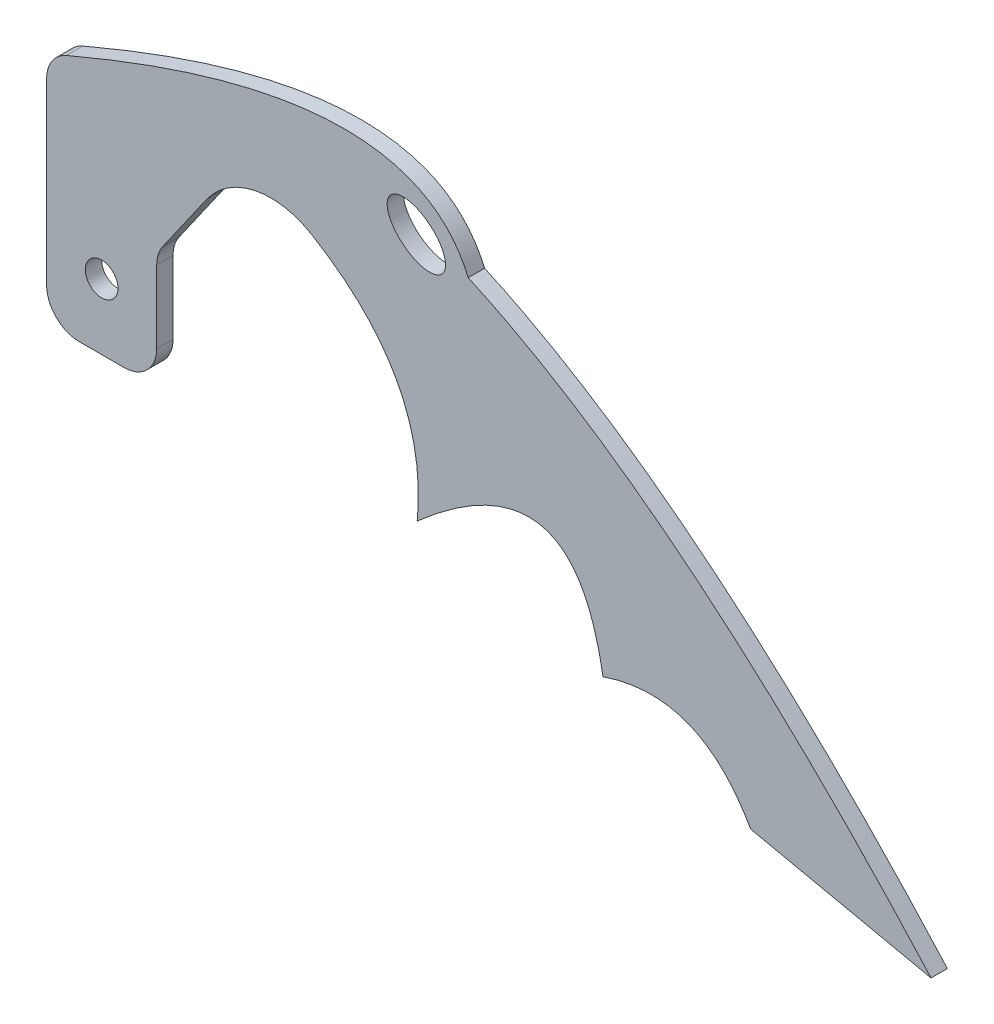
ISO-10303-21;
HEADER;
FILE_DESCRIPTION(('STEP AP214'),'2;1');
FILE_NAME('part.step','',(''),(''),'','','');
FILE_SCHEMA(('AUTOMOTIVE_DESIGN { 1 0 10303 214 1 1 1 1 }'));
ENDSEC;
DATA;
#1=APPLICATION_CONTEXT('core data for automotive mechanical design processes');
#2=APPLICATION_PROTOCOL_DEFINITION('international standard','automotive_design',2000,#1);
#3=PRODUCT_CONTEXT('',#1,'mechanical');
#4=PRODUCT('Part','Part','',(#3));
#5=PRODUCT_RELATED_PRODUCT_CATEGORY('part','',(#4));
#6=PRODUCT_DEFINITION_FORMATION('','',#4);
#7=PRODUCT_DEFINITION_CONTEXT('part definition',#1,'design');
#8=PRODUCT_DEFINITION('design','',#6,#7);
#9=PRODUCT_DEFINITION_SHAPE('','',#8);
#10=(LENGTH_UNIT() NAMED_UNIT(*) SI_UNIT(.MILLI.,.METRE.));
#11=(NAMED_UNIT(*) PLANE_ANGLE_UNIT() SI_UNIT($,.RADIAN.));
#12=(NAMED_UNIT(*) SI_UNIT($,.STERADIAN.) SOLID_ANGLE_UNIT());
#13=UNCERTAINTY_MEASURE_WITH_UNIT(LENGTH_MEASURE(1.E-05),#10,'distance_accuracy_value','');
#14=(GEOMETRIC_REPRESENTATION_CONTEXT(3) GLOBAL_UNCERTAINTY_ASSIGNED_CONTEXT((#13)) GLOBAL_UNIT_ASSIGNED_CONTEXT((#10,
#11,#12)) REPRESENTATION_CONTEXT('',''));
#15=CARTESIAN_POINT('',(0.,0.,0.));
#16=DIRECTION('',(0.,0.,1.));
#17=DIRECTION('',(1.,0.,0.));
#18=AXIS2_PLACEMENT_3D('',#15,#16,#17);
#19=CARTESIAN_POINT('',(-85.8379905464386,33.8069712216484,3.175));
#20=CARTESIAN_POINT('',(-15.7088284844414,64.7051053089829,3.175));
#21=CARTESIAN_POINT('',(-3.9965246979184,37.1134376597058,3.175));
#22=B_SPLINE_CURVE_WITH_KNOTS('',2,(#19,#20,#21),.UNSPECIFIED.,.F.,.F.,(3,3),(0.,
0.406769717209253),.UNSPECIFIED.);
#23=DIRECTION('',(0.,0.,-1.));
#24=VECTOR('',#23,1.);
#25=SURFACE_OF_LINEAR_EXTRUSION('',#22,#24);
#26=CARTESIAN_POINT('',(-85.8379905464386,33.8069712216484,0.));
#27=CARTESIAN_POINT('',(-15.7088284844414,64.7051053089829,0.));
#28=CARTESIAN_POINT('',(-3.9965246979184,37.1134376597058,0.));
#29=B_SPLINE_CURVE_WITH_KNOTS('',2,(#26,#27,#28),.UNSPECIFIED.,.F.,.F.,(3,3),(0.,
0.406769717209253),.UNSPECIFIED.);
#30=CARTESIAN_POINT('',(-81.9830787004978,35.4800790941785,0.));
#31=VERTEX_POINT('',#30);
#32=CARTESIAN_POINT('',(-3.9965246979184,37.1134376597058,0.));
#33=VERTEX_POINT('',#32);
#34=EDGE_CURVE('E289',#31,#33,#29,.T.);
#35=ORIENTED_EDGE('',*,*,#34,.F.);
#36=DIRECTION('',(0.,0.,-1.));
#37=VECTOR('',#36,1.);
#38=CARTESIAN_POINT('',(-81.9830787004978,35.4800790941785,0.));
#39=LINE('',#38,#37);
#40=CARTESIAN_POINT('',(-81.9830787004978,35.4800790941785,3.175));
#41=VERTEX_POINT('',#40);
#42=EDGE_CURVE('E43',#31,#41,#39,.F.);
#43=ORIENTED_EDGE('',*,*,#42,.T.);
#44=CARTESIAN_POINT('',(-3.9965246979184,37.1134376597058,3.175));
#45=VERTEX_POINT('',#44);
#46=EDGE_CURVE('E214',#41,#45,#22,.T.);
#47=ORIENTED_EDGE('',*,*,#46,.T.);
#48=DIRECTION('',(0.,0.,-1.));
#49=VECTOR('',#48,1.);
#50=CARTESIAN_POINT('',(-3.9965246979184,37.1134376597058,3.175));
#51=LINE('',#50,#49);
#52=EDGE_CURVE('E339',#45,#33,#51,.T.);
#53=ORIENTED_EDGE('',*,*,#52,.T.);
#54=EDGE_LOOP('',(#35,#43,#47,#53));
#55=FACE_BOUND('',#54,.T.);
#56=ADVANCED_FACE('F35',(#55),#25,.T.);
#57=CARTESIAN_POINT('',(-85.8379905464386,0.,3.175));
#58=DIRECTION('',(-1.,0.,0.));
#59=DIRECTION('',(0.,0.,1.));
#60=AXIS2_PLACEMENT_3D('',#57,#58,#59);
#61=PLANE('',#60);
#62=DIRECTION('',(0.,1.,0.));
#63=VECTOR('',#62,1.);
#64=CARTESIAN_POINT('',(-85.8379905464386,0.,3.175));
#65=LINE('',#64,#63);
#66=CARTESIAN_POINT('',(-85.8379905464386,-5.03869252194113,3.175));
#67=VERTEX_POINT('',#66);
#68=CARTESIAN_POINT('',(-85.8379905464386,29.6408124361577,3.175));
#69=VERTEX_POINT('',#68);
#70=EDGE_CURVE('E219',#67,#69,#65,.T.);
#71=ORIENTED_EDGE('',*,*,#70,.T.);
#72=DIRECTION('',(0.,0.,-1.));
#73=VECTOR('',#72,1.);
#74=CARTESIAN_POINT('',(-85.8379905464386,29.6408124361577,3.175));
#75=LINE('',#74,#73);
#76=CARTESIAN_POINT('',(-85.8379905464386,29.6408124361577,0.));
#77=VERTEX_POINT('',#76);
#78=EDGE_CURVE('E275',#69,#77,#75,.T.);
#79=ORIENTED_EDGE('',*,*,#78,.T.);
#80=DIRECTION('',(0.,1.,0.));
#81=VECTOR('',#80,1.);
#82=CARTESIAN_POINT('',(-85.8379905464386,0.,0.));
#83=LINE('',#82,#81);
#84=CARTESIAN_POINT('',(-85.8379905464386,-5.03869252194113,0.));
#85=VERTEX_POINT('',#84);
#86=EDGE_CURVE('E280',#85,#77,#83,.T.);
#87=ORIENTED_EDGE('',*,*,#86,.F.);
#88=DIRECTION('',(0.,0.,-1.));
#89=VECTOR('',#88,1.);
#90=CARTESIAN_POINT('',(-85.8379905464386,-5.03869252194113,3.175));
#91=LINE('',#90,#89);
#92=EDGE_CURVE('E263',#85,#67,#91,.F.);
#93=ORIENTED_EDGE('',*,*,#92,.T.);
#94=EDGE_LOOP('',(#71,#79,#87,#93));
#95=FACE_BOUND('',#94,.T.);
#96=ADVANCED_FACE('F204',(#95),#61,.T.);
#97=CARTESIAN_POINT('',(0.,-11.3886925219411,3.175));
#98=DIRECTION('',(0.,-1.,0.));
#99=DIRECTION('',(0.,0.,-1.));
#100=AXIS2_PLACEMENT_3D('',#97,#98,#99);
#101=PLANE('',#100);
#102=DIRECTION('',(-1.,0.,0.));
#103=VECTOR('',#102,1.);
#104=CARTESIAN_POINT('',(0.,-11.3886925219411,3.175));
#105=LINE('',#104,#103);
#106=CARTESIAN_POINT('',(-70.8114561328052,-11.3886925219411,3.175));
#107=VERTEX_POINT('',#106);
#108=CARTESIAN_POINT('',(-79.4879905464386,-11.3886925219411,3.175));
#109=VERTEX_POINT('',#108);
#110=EDGE_CURVE('E226',#107,#109,#105,.T.);
#111=ORIENTED_EDGE('',*,*,#110,.T.);
#112=DIRECTION('',(0.,0.,-1.));
#113=VECTOR('',#112,1.);
#114=CARTESIAN_POINT('',(-79.4879905464386,-11.3886925219411,3.175));
#115=LINE('',#114,#113);
#116=CARTESIAN_POINT('',(-79.4879905464386,-11.3886925219411,0.));
#117=VERTEX_POINT('',#116);
#118=EDGE_CURVE('E256',#109,#117,#115,.T.);
#119=ORIENTED_EDGE('',*,*,#118,.T.);
#120=DIRECTION('',(-1.,0.,0.));
#121=VECTOR('',#120,1.);
#122=CARTESIAN_POINT('',(0.,-11.3886925219411,0.));
#123=LINE('',#122,#121);
#124=CARTESIAN_POINT('',(-70.8114561328052,-11.3886925219411,0.));
#125=VERTEX_POINT('',#124);
#126=EDGE_CURVE('E288',#125,#117,#123,.T.);
#127=ORIENTED_EDGE('',*,*,#126,.F.);
#128=DIRECTION('',(0.,0.,-1.));
#129=VECTOR('',#128,1.);
#130=CARTESIAN_POINT('',(-70.8114561328052,-11.3886925219411,3.175));
#131=LINE('',#130,#129);
#132=EDGE_CURVE('E254',#125,#107,#131,.F.);
#133=ORIENTED_EDGE('',*,*,#132,.T.);
#134=EDGE_LOOP('',(#111,#119,#127,#133));
#135=FACE_BOUND('',#134,.T.);
#136=ADVANCED_FACE('F200',(#135),#101,.T.);
#137=CARTESIAN_POINT('',(-64.4614561328052,0.,3.175));
#138=DIRECTION('',(1.,0.,0.));
#139=DIRECTION('',(0.,0.,-1.));
#140=AXIS2_PLACEMENT_3D('',#137,#138,#139);
#141=PLANE('',#140);
#142=DIRECTION('',(0.,-1.,0.));
#143=VECTOR('',#142,1.);
#144=CARTESIAN_POINT('',(-64.4614561328052,0.,0.));
#145=LINE('',#144,#143);
#146=CARTESIAN_POINT('',(-64.4614561328052,9.04010308108455,0.));
#147=VERTEX_POINT('',#146);
#148=CARTESIAN_POINT('',(-64.4614561328052,-5.03869252194113,0.));
#149=VERTEX_POINT('',#148);
#150=EDGE_CURVE('E291',#147,#149,#145,.T.);
#151=ORIENTED_EDGE('',*,*,#150,.F.);
#152=DIRECTION('',(0.,0.,-1.));
#153=VECTOR('',#152,1.);
#154=CARTESIAN_POINT('',(-64.4614561328052,9.04010308108455,3.175));
#155=LINE('',#154,#153);
#156=CARTESIAN_POINT('',(-64.4614561328052,9.04010308108455,3.175));
#157=VERTEX_POINT('',#156);
#158=EDGE_CURVE('E249',#147,#157,#155,.F.);
#159=ORIENTED_EDGE('',*,*,#158,.T.);
#160=DIRECTION('',(0.,-1.,0.));
#161=VECTOR('',#160,1.);
#162=CARTESIAN_POINT('',(-64.4614561328052,0.,3.175));
#163=LINE('',#162,#161);
#164=CARTESIAN_POINT('',(-64.4614561328052,-5.03869252194113,3.175));
#165=VERTEX_POINT('',#164);
#166=EDGE_CURVE('E229',#157,#165,#163,.T.);
#167=ORIENTED_EDGE('',*,*,#166,.T.);
#168=DIRECTION('',(0.,0.,-1.));
#169=VECTOR('',#168,1.);
#170=CARTESIAN_POINT('',(-64.4614561328052,-5.03869252194113,3.175));
#171=LINE('',#170,#169);
#172=EDGE_CURVE('E246',#165,#149,#171,.T.);
#173=ORIENTED_EDGE('',*,*,#172,.T.);
#174=EDGE_LOOP('',(#151,#159,#167,#173));
#175=FACE_BOUND('',#174,.T.);
#176=ADVANCED_FACE('F196',(#175),#141,.T.);
#177=CARTESIAN_POINT('',(-48.4620422200186,33.9078305521144,3.175));
#178=DIRECTION('',(0.819355803707902,-0.573285327677395,0.));
#179=DIRECTION('',(0.573285327677395,0.819355803707902,0.));
#180=AXIS2_PLACEMENT_3D('',#177,#178,#179);
#181=PLANE('',#180);
#182=DIRECTION('',(-0.573285327677395,-0.819355803707902,0.));
#183=VECTOR('',#182,1.);
#184=CARTESIAN_POINT('',(-48.4620422200186,33.9078305521144,0.));
#185=LINE('',#184,#183);
#186=CARTESIAN_POINT('',(-54.7815294131634,24.8758385261913,0.));
#187=VERTEX_POINT('',#186);
#188=CARTESIAN_POINT('',(-63.3143654863504,12.680464911836,0.));
#189=VERTEX_POINT('',#188);
#190=EDGE_CURVE('E300',#187,#189,#185,.T.);
#191=ORIENTED_EDGE('',*,*,#190,.F.);
#192=DIRECTION('',(0.,0.,-1.));
#193=VECTOR('',#192,1.);
#194=CARTESIAN_POINT('',(-54.7815294131634,24.8758385261913,3.175));
#195=LINE('',#194,#193);
#196=CARTESIAN_POINT('',(-54.7815294131634,24.8758385261913,3.175));
#197=VERTEX_POINT('',#196);
#198=EDGE_CURVE('E236',#187,#197,#195,.F.);
#199=ORIENTED_EDGE('',*,*,#198,.T.);
#200=DIRECTION('',(-0.573285327677395,-0.819355803707902,0.));
#201=VECTOR('',#200,1.);
#202=CARTESIAN_POINT('',(-48.4620422200186,33.9078305521144,3.175));
#203=LINE('',#202,#201);
#204=CARTESIAN_POINT('',(-63.3143654863504,12.680464911836,3.175));
#205=VERTEX_POINT('',#204);
#206=EDGE_CURVE('E152',#197,#205,#203,.T.);
#207=ORIENTED_EDGE('',*,*,#206,.T.);
#208=DIRECTION('',(0.,0.,-1.));
#209=VECTOR('',#208,1.);
#210=CARTESIAN_POINT('',(-63.3143654863504,12.680464911836,0.));
#211=LINE('',#210,#209);
#212=EDGE_CURVE('E161',#205,#189,#211,.T.);
#213=ORIENTED_EDGE('',*,*,#212,.T.);
#214=EDGE_LOOP('',(#191,#199,#207,#213));
#215=FACE_BOUND('',#214,.T.);
#216=ADVANCED_FACE('F193',(#215),#181,.T.);
#217=CARTESIAN_POINT('',(-47.4407853127549,35.367440162975,3.175));
#218=CARTESIAN_POINT('',(-10.9423189195886,21.5659161324047,3.175));
#219=CARTESIAN_POINT('',(-13.8981203898325,-8.73455108978297,3.175));
#220=B_SPLINE_CURVE_WITH_KNOTS('',2,(#217,#218,#219),.UNSPECIFIED.,.F.,.F.,(3,3),(0.,1.),.UNSPECIFIED.);
#221=DIRECTION('',(0.,0.,-1.));
#222=VECTOR('',#221,1.);
#223=SURFACE_OF_LINEAR_EXTRUSION('',#220,#222);
#224=CARTESIAN_POINT('',(-34.4919723766965,29.2300903976418,3.175));
#225=VERTEX_POINT('',#224);
#226=CARTESIAN_POINT('',(-13.8981203898325,-8.73455108978297,3.175));
#227=VERTEX_POINT('',#226);
#228=EDGE_CURVE('E139',#225,#227,#220,.T.);
#229=ORIENTED_EDGE('',*,*,#228,.F.);
#230=DIRECTION('',(0.,0.,-1.));
#231=VECTOR('',#230,1.);
#232=CARTESIAN_POINT('',(-34.4919723766965,29.2300903976418,3.175));
#233=LINE('',#232,#231);
#234=CARTESIAN_POINT('',(-34.4919723766965,29.2300903976418,0.));
#235=VERTEX_POINT('',#234);
#236=EDGE_CURVE('E242',#225,#235,#233,.T.);
#237=ORIENTED_EDGE('',*,*,#236,.T.);
#238=CARTESIAN_POINT('',(-47.4407853127549,35.367440162975,0.));
#239=CARTESIAN_POINT('',(-10.9423189195886,21.5659161324047,0.));
#240=CARTESIAN_POINT('',(-13.8981203898325,-8.73455108978297,0.));
#241=B_SPLINE_CURVE_WITH_KNOTS('',2,(#238,#239,#240),.UNSPECIFIED.,.F.,.F.,(3,3),(0.,1.),.UNSPECIFIED.);
#242=CARTESIAN_POINT('',(-13.8981203898325,-8.73455108978297,0.));
#243=VERTEX_POINT('',#242);
#244=EDGE_CURVE('E158',#235,#243,#241,.T.);
#245=ORIENTED_EDGE('',*,*,#244,.T.);
#246=DIRECTION('',(0.,0.,-1.));
#247=VECTOR('',#246,1.);
#248=CARTESIAN_POINT('',(-13.8981203898325,-8.73455108978297,3.175));
#249=LINE('',#248,#247);
#250=EDGE_CURVE('E155',#227,#243,#249,.T.);
#251=ORIENTED_EDGE('',*,*,#250,.F.);
#252=EDGE_LOOP('',(#229,#237,#245,#251));
#253=FACE_BOUND('',#252,.T.);
#254=ADVANCED_FACE('F156',(#253),#223,.F.);
#255=CARTESIAN_POINT('',(-13.8981203898325,-8.73455108978297,3.175));
#256=CARTESIAN_POINT('',(16.3543958885412,17.832088287541,3.175));
#257=CARTESIAN_POINT('',(22.1515077936374,-16.8830600603727,3.175));
#258=B_SPLINE_CURVE_WITH_KNOTS('',2,(#255,#256,#257),.UNSPECIFIED.,.F.,.F.,(3,3),(0.,1.),.UNSPECIFIED.);
#259=DIRECTION('',(0.,0.,-1.));
#260=VECTOR('',#259,1.);
#261=SURFACE_OF_LINEAR_EXTRUSION('',#258,#260);
#262=CARTESIAN_POINT('',(-13.8981203898325,-8.73455108978297,0.));
#263=CARTESIAN_POINT('',(16.3543958885412,17.832088287541,0.));
#264=CARTESIAN_POINT('',(22.1515077936374,-16.8830600603727,0.));
#265=B_SPLINE_CURVE_WITH_KNOTS('',2,(#262,#263,#264),.UNSPECIFIED.,.F.,.F.,(3,3),(0.,1.),.UNSPECIFIED.);
#266=CARTESIAN_POINT('',(22.1515077936374,-16.8830600603727,0.));
#267=VERTEX_POINT('',#266);
#268=EDGE_CURVE('E305',#243,#267,#265,.T.);
#269=ORIENTED_EDGE('',*,*,#268,.T.);
#270=DIRECTION('',(0.,0.,-1.));
#271=VECTOR('',#270,1.);
#272=CARTESIAN_POINT('',(22.1515077936374,-16.8830600603727,3.175));
#273=LINE('',#272,#271);
#274=CARTESIAN_POINT('',(22.1515077936374,-16.8830600603727,3.175));
#275=VERTEX_POINT('',#274);
#276=EDGE_CURVE('E162',#275,#267,#273,.T.);
#277=ORIENTED_EDGE('',*,*,#276,.F.);
#278=EDGE_CURVE('E144',#227,#275,#258,.T.);
#279=ORIENTED_EDGE('',*,*,#278,.F.);
#280=ORIENTED_EDGE('',*,*,#250,.T.);
#281=EDGE_LOOP('',(#269,#277,#279,#280));
#282=FACE_BOUND('',#281,.T.);
#283=ADVANCED_FACE('F164',(#282),#261,.F.);
#284=CARTESIAN_POINT('',(22.1515077936374,-16.8830600603727,3.175));
#285=CARTESIAN_POINT('',(40.9334850801293,-10.4779374257057,3.175));
#286=CARTESIAN_POINT('',(50.8154288110896,-28.1694332193718,3.175));
#287=B_SPLINE_CURVE_WITH_KNOTS('',2,(#284,#285,#286),.UNSPECIFIED.,.F.,.F.,(3,3),(0.,1.),.UNSPECIFIED.);
#288=DIRECTION('',(0.,0.,-1.));
#289=VECTOR('',#288,1.);
#290=SURFACE_OF_LINEAR_EXTRUSION('',#287,#289);
#291=CARTESIAN_POINT('',(22.1515077936374,-16.8830600603727,0.));
#292=CARTESIAN_POINT('',(40.9334850801293,-10.4779374257057,0.));
#293=CARTESIAN_POINT('',(50.8154288110896,-28.1694332193718,0.));
#294=B_SPLINE_CURVE_WITH_KNOTS('',2,(#291,#292,#293),.UNSPECIFIED.,.F.,.F.,(3,3),(0.,1.),.UNSPECIFIED.);
#295=CARTESIAN_POINT('',(50.8154288110896,-28.1694332193718,0.));
#296=VERTEX_POINT('',#295);
#297=EDGE_CURVE('E312',#267,#296,#294,.T.);
#298=ORIENTED_EDGE('',*,*,#297,.T.);
#299=DIRECTION('',(0.,0.,-1.));
#300=VECTOR('',#299,1.);
#301=CARTESIAN_POINT('',(50.8154288110896,-28.1694332193718,3.175));
#302=LINE('',#301,#300);
#303=CARTESIAN_POINT('',(50.8154288110896,-28.1694332193718,3.175));
#304=VERTEX_POINT('',#303);
#305=EDGE_CURVE('E345',#304,#296,#302,.T.);
#306=ORIENTED_EDGE('',*,*,#305,.F.);
#307=EDGE_CURVE('E167',#275,#304,#287,.T.);
#308=ORIENTED_EDGE('',*,*,#307,.F.);
#309=ORIENTED_EDGE('',*,*,#276,.T.);
#310=EDGE_LOOP('',(#298,#306,#308,#309));
#311=FACE_BOUND('',#310,.T.);
#312=ADVANCED_FACE('F189',(#311),#290,.F.);
#313=CARTESIAN_POINT('',(-3.54203530943372,-16.5019846397132,3.175));
#314=DIRECTION('',(-0.209863059172677,-0.977730789325306,0.));
#315=DIRECTION('',(0.977730789325306,-0.209863059172677,0.));
#316=AXIS2_PLACEMENT_3D('',#313,#314,#315);
#317=PLANE('',#316);
#318=DIRECTION('',(-0.977730789325306,0.209863059172677,0.));
#319=VECTOR('',#318,1.);
#320=CARTESIAN_POINT('',(-3.54203530943372,-16.5019846397132,0.));
#321=LINE('',#320,#319);
#322=CARTESIAN_POINT('',(85.8379905464386,-35.6867805567879,0.));
#323=VERTEX_POINT('',#322);
#324=EDGE_CURVE('E320',#323,#296,#321,.T.);
#325=ORIENTED_EDGE('',*,*,#324,.F.);
#326=DIRECTION('',(0.,0.,-1.));
#327=VECTOR('',#326,1.);
#328=CARTESIAN_POINT('',(85.8379905464386,-35.6867805567879,3.175));
#329=LINE('',#328,#327);
#330=CARTESIAN_POINT('',(85.8379905464386,-35.6867805567879,3.175));
#331=VERTEX_POINT('',#330);
#332=EDGE_CURVE('E342',#331,#323,#329,.T.);
#333=ORIENTED_EDGE('',*,*,#332,.F.);
#334=DIRECTION('',(-0.977730789325306,0.209863059172677,0.));
#335=VECTOR('',#334,1.);
#336=CARTESIAN_POINT('',(-3.54203530943372,-16.5019846397132,3.175));
#337=LINE('',#336,#335);
#338=EDGE_CURVE('E169',#331,#304,#337,.T.);
#339=ORIENTED_EDGE('',*,*,#338,.T.);
#340=ORIENTED_EDGE('',*,*,#305,.T.);
#341=EDGE_LOOP('',(#325,#333,#339,#340));
#342=FACE_BOUND('',#341,.T.);
#343=ADVANCED_FACE('F352',(#342),#317,.T.);
#344=CARTESIAN_POINT('',(-14.0659085887708,39.3465280793994,3.175));
#345=DIRECTION('',(0.,0.,1.));
#346=DIRECTION('',(-0.789352217376326,0.613940613514921,0.));
#347=AXIS2_PLACEMENT_3D('',#344,#345,#346);
#348=ELLIPSE('',#347,6.5017310694354,3.91770974696751);
#349=DIRECTION('',(0.,0.,-1.));
#350=VECTOR('',#349,1.);
#351=SURFACE_OF_LINEAR_EXTRUSION('',#348,#350);
#352=CARTESIAN_POINT('',(-19.1980644252142,43.3382048410776,3.175));
#353=VERTEX_POINT('',#352);
#354=EDGE_CURVE('E358',#353,#353,#348,.T.);
#355=ORIENTED_EDGE('',*,*,#354,.T.);
#356=EDGE_LOOP('',(#355));
#357=FACE_BOUND('',#356,.T.);
#358=CARTESIAN_POINT('',(-14.0659085887708,39.3465280793994,0.));
#359=DIRECTION('',(0.,0.,1.));
#360=DIRECTION('',(-0.789352217376326,0.613940613514921,0.));
#361=AXIS2_PLACEMENT_3D('',#358,#359,#360);
#362=ELLIPSE('',#361,6.5017310694354,3.91770974696751);
#363=CARTESIAN_POINT('',(-19.1980644252142,43.3382048410776,0.));
#364=VERTEX_POINT('',#363);
#365=EDGE_CURVE('E331',#364,#364,#362,.T.);
#366=ORIENTED_EDGE('',*,*,#365,.F.);
#367=EDGE_LOOP('',(#366));
#368=FACE_BOUND('',#367,.T.);
#369=ADVANCED_FACE('F373',(#357,#368),#351,.T.);
#370=CARTESIAN_POINT('',(85.8379905464386,-35.6867805567879,3.175));
#371=CARTESIAN_POINT('',(37.0454395633073,18.6313468414419,3.175));
#372=CARTESIAN_POINT('',(-3.9965246979184,37.1134376597058,3.175));
#373=B_SPLINE_CURVE_WITH_KNOTS('',2,(#370,#371,#372),.UNSPECIFIED.,.F.,.F.,(3,3),(0.,
0.371923550946807),.UNSPECIFIED.);
#374=DIRECTION('',(0.,0.,-1.));
#375=VECTOR('',#374,1.);
#376=SURFACE_OF_LINEAR_EXTRUSION('',#373,#375);
#377=CARTESIAN_POINT('',(85.8379905464386,-35.6867805567879,0.));
#378=CARTESIAN_POINT('',(37.0454395633073,18.6313468414419,0.));
#379=CARTESIAN_POINT('',(-3.9965246979184,37.1134376597058,0.));
#380=B_SPLINE_CURVE_WITH_KNOTS('',2,(#377,#378,#379),.UNSPECIFIED.,.F.,.F.,(3,3),(0.,
0.371923550946807),.UNSPECIFIED.);
#381=EDGE_CURVE('E326',#323,#33,#380,.T.);
#382=ORIENTED_EDGE('',*,*,#381,.T.);
#383=ORIENTED_EDGE('',*,*,#52,.F.);
#384=EDGE_CURVE('E357',#331,#45,#373,.T.);
#385=ORIENTED_EDGE('',*,*,#384,.F.);
#386=ORIENTED_EDGE('',*,*,#332,.T.);
#387=EDGE_LOOP('',(#382,#383,#385,#386));
#388=FACE_BOUND('',#387,.T.);
#389=ADVANCED_FACE('F369',(#388),#376,.F.);
#390=CARTESIAN_POINT('',(-75.1497233396219,1.32373168535043,3.175));
#391=DIRECTION('',(0.,0.,-1.));
#392=DIRECTION('',(-1.,0.,0.));
#393=AXIS2_PLACEMENT_3D('',#390,#391,#392);
#394=CYLINDRICAL_SURFACE('',#393,3.175);
#395=CARTESIAN_POINT('',(-75.1497233396219,1.32373168535043,3.175));
#396=DIRECTION('',(0.,0.,1.));
#397=DIRECTION('',(1.,0.,0.));
#398=AXIS2_PLACEMENT_3D('',#395,#396,#397);
#399=CIRCLE('',#398,3.175);
#400=CARTESIAN_POINT('',(-71.9747233396219,1.32373168535043,3.175));
#401=VERTEX_POINT('',#400);
#402=EDGE_CURVE('E343',#401,#401,#399,.T.);
#403=ORIENTED_EDGE('',*,*,#402,.T.);
#404=EDGE_LOOP('',(#403));
#405=FACE_BOUND('',#404,.T.);
#406=CARTESIAN_POINT('',(-75.1497233396219,1.32373168535043,0.));
#407=DIRECTION('',(0.,0.,1.));
#408=DIRECTION('',(1.,0.,0.));
#409=AXIS2_PLACEMENT_3D('',#406,#407,#408);
#410=CIRCLE('',#409,3.175);
#411=CARTESIAN_POINT('',(-71.9747233396219,1.32373168535043,0.));
#412=VERTEX_POINT('',#411);
#413=EDGE_CURVE('E220',#412,#412,#410,.T.);
#414=ORIENTED_EDGE('',*,*,#413,.F.);
#415=EDGE_LOOP('',(#414));
#416=FACE_BOUND('',#415,.T.);
#417=ADVANCED_FACE('F372',(#405,#416),#394,.F.);
#418=CARTESIAN_POINT('',(0.,0.,3.175));
#419=DIRECTION('',(0.,0.,1.));
#420=DIRECTION('',(1.,0.,0.));
#421=AXIS2_PLACEMENT_3D('',#418,#419,#420);
#422=PLANE('',#421);
#423=ORIENTED_EDGE('',*,*,#46,.F.);
#424=CARTESIAN_POINT('',(-79.4879905464386,29.6408124361577,3.175));
#425=DIRECTION('',(0.,0.,1.));
#426=DIRECTION('',(1.,0.,0.));
#427=AXIS2_PLACEMENT_3D('',#424,#425,#426);
#428=CIRCLE('',#427,6.35);
#429=EDGE_CURVE('E11',#41,#69,#428,.T.);
#430=ORIENTED_EDGE('',*,*,#429,.T.);
#431=ORIENTED_EDGE('',*,*,#70,.F.);
#432=CARTESIAN_POINT('',(-79.4879905464386,-5.03869252194113,3.175));
#433=DIRECTION('',(0.,0.,1.));
#434=DIRECTION('',(1.,0.,0.));
#435=AXIS2_PLACEMENT_3D('',#432,#433,#434);
#436=CIRCLE('',#435,6.35);
#437=EDGE_CURVE('E267',#67,#109,#436,.T.);
#438=ORIENTED_EDGE('',*,*,#437,.T.);
#439=ORIENTED_EDGE('',*,*,#110,.F.);
#440=CARTESIAN_POINT('',(-70.8114561328052,-5.03869252194113,3.175));
#441=DIRECTION('',(0.,0.,1.));
#442=DIRECTION('',(1.,0.,0.));
#443=AXIS2_PLACEMENT_3D('',#440,#441,#442);
#444=CIRCLE('',#443,6.35);
#445=EDGE_CURVE('E265',#107,#165,#444,.T.);
#446=ORIENTED_EDGE('',*,*,#445,.T.);
#447=ORIENTED_EDGE('',*,*,#166,.F.);
#448=CARTESIAN_POINT('',(-58.1114561328052,9.04010308108455,3.175));
#449=DIRECTION('',(0.,0.,1.));
#450=DIRECTION('',(1.,0.,0.));
#451=AXIS2_PLACEMENT_3D('',#448,#449,#450);
#452=CIRCLE('',#451,6.35);
#453=EDGE_CURVE('E239',#157,#205,#452,.F.);
#454=ORIENTED_EDGE('',*,*,#453,.T.);
#455=ORIENTED_EDGE('',*,*,#206,.F.);
#456=CARTESIAN_POINT('',(-42.294546964655,16.1389701323878,3.175));
#457=DIRECTION('',(0.,0.,1.));
#458=DIRECTION('',(1.,0.,0.));
#459=AXIS2_PLACEMENT_3D('',#456,#457,#458);
#460=CIRCLE('',#459,15.24);
#461=EDGE_CURVE('E148',#197,#225,#460,.F.);
#462=ORIENTED_EDGE('',*,*,#461,.T.);
#463=ORIENTED_EDGE('',*,*,#228,.T.);
#464=ORIENTED_EDGE('',*,*,#278,.T.);
#465=ORIENTED_EDGE('',*,*,#307,.T.);
#466=ORIENTED_EDGE('',*,*,#338,.F.);
#467=ORIENTED_EDGE('',*,*,#384,.T.);
#468=EDGE_LOOP('',(#423,#430,#431,#438,#439,#446,#447,#454,#455,#462,#463,#464,#465,#466,#467));
#469=FACE_BOUND('',#468,.T.);
#470=ORIENTED_EDGE('',*,*,#354,.F.);
#471=EDGE_LOOP('',(#470));
#472=FACE_BOUND('',#471,.T.);
#473=ORIENTED_EDGE('',*,*,#402,.F.);
#474=EDGE_LOOP('',(#473));
#475=FACE_BOUND('',#474,.T.);
#476=ADVANCED_FACE('F141',(#469,#472,#475),#422,.T.);
#477=CARTESIAN_POINT('',(0.,0.,0.));
#478=DIRECTION('',(0.,0.,1.));
#479=DIRECTION('',(1.,0.,0.));
#480=AXIS2_PLACEMENT_3D('',#477,#478,#479);
#481=PLANE('',#480);
#482=ORIENTED_EDGE('',*,*,#86,.T.);
#483=CARTESIAN_POINT('',(-79.4879905464386,29.6408124361577,0.));
#484=DIRECTION('',(0.,0.,1.));
#485=DIRECTION('',(1.,0.,0.));
#486=AXIS2_PLACEMENT_3D('',#483,#484,#485);
#487=CIRCLE('',#486,6.35);
#488=EDGE_CURVE('E57',#77,#31,#487,.F.);
#489=ORIENTED_EDGE('',*,*,#488,.T.);
#490=ORIENTED_EDGE('',*,*,#34,.T.);
#491=ORIENTED_EDGE('',*,*,#381,.F.);
#492=ORIENTED_EDGE('',*,*,#324,.T.);
#493=ORIENTED_EDGE('',*,*,#297,.F.);
#494=ORIENTED_EDGE('',*,*,#268,.F.);
#495=ORIENTED_EDGE('',*,*,#244,.F.);
#496=CARTESIAN_POINT('',(-42.294546964655,16.1389701323878,0.));
#497=DIRECTION('',(0.,0.,1.));
#498=DIRECTION('',(1.,0.,0.));
#499=AXIS2_PLACEMENT_3D('',#496,#497,#498);
#500=CIRCLE('',#499,15.24);
#501=EDGE_CURVE('E272',#235,#187,#500,.T.);
#502=ORIENTED_EDGE('',*,*,#501,.T.);
#503=ORIENTED_EDGE('',*,*,#190,.T.);
#504=CARTESIAN_POINT('',(-58.1114561328052,9.04010308108455,0.));
#505=DIRECTION('',(0.,0.,1.));
#506=DIRECTION('',(1.,0.,0.));
#507=AXIS2_PLACEMENT_3D('',#504,#505,#506);
#508=CIRCLE('',#507,6.35);
#509=EDGE_CURVE('E243',#189,#147,#508,.T.);
#510=ORIENTED_EDGE('',*,*,#509,.T.);
#511=ORIENTED_EDGE('',*,*,#150,.T.);
#512=CARTESIAN_POINT('',(-70.8114561328052,-5.03869252194113,0.));
#513=DIRECTION('',(0.,0.,1.));
#514=DIRECTION('',(1.,0.,0.));
#515=AXIS2_PLACEMENT_3D('',#512,#513,#514);
#516=CIRCLE('',#515,6.35);
#517=EDGE_CURVE('E259',#149,#125,#516,.F.);
#518=ORIENTED_EDGE('',*,*,#517,.T.);
#519=ORIENTED_EDGE('',*,*,#126,.T.);
#520=CARTESIAN_POINT('',(-79.4879905464386,-5.03869252194113,0.));
#521=DIRECTION('',(0.,0.,1.));
#522=DIRECTION('',(1.,0.,0.));
#523=AXIS2_PLACEMENT_3D('',#520,#521,#522);
#524=CIRCLE('',#523,6.35);
#525=EDGE_CURVE('E261',#117,#85,#524,.F.);
#526=ORIENTED_EDGE('',*,*,#525,.T.);
#527=EDGE_LOOP('',(#482,#489,#490,#491,#492,#493,#494,#495,#502,#503,#510,#511,#518,#519,#526));
#528=FACE_BOUND('',#527,.T.);
#529=ORIENTED_EDGE('',*,*,#365,.T.);
#530=EDGE_LOOP('',(#529));
#531=FACE_BOUND('',#530,.T.);
#532=ORIENTED_EDGE('',*,*,#413,.T.);
#533=EDGE_LOOP('',(#532));
#534=FACE_BOUND('',#533,.T.);
#535=ADVANCED_FACE('F285',(#528,#531,#534),#481,.F.);
#536=CARTESIAN_POINT('',(-58.1114561328052,9.04010308108455,3.175));
#537=DIRECTION('',(0.,0.,1.));
#538=DIRECTION('',(1.,0.,0.));
#539=AXIS2_PLACEMENT_3D('',#536,#537,#538);
#540=CYLINDRICAL_SURFACE('',#539,6.35);
#541=ORIENTED_EDGE('',*,*,#453,.F.);
#542=ORIENTED_EDGE('',*,*,#158,.F.);
#543=ORIENTED_EDGE('',*,*,#509,.F.);
#544=ORIENTED_EDGE('',*,*,#212,.F.);
#545=EDGE_LOOP('',(#541,#542,#543,#544));
#546=FACE_BOUND('',#545,.T.);
#547=ADVANCED_FACE('F212',(#546),#540,.F.);
#548=CARTESIAN_POINT('',(-79.4879905464386,-5.03869252194113,3.175));
#549=DIRECTION('',(0.,0.,-1.));
#550=DIRECTION('',(-1.,0.,0.));
#551=AXIS2_PLACEMENT_3D('',#548,#549,#550);
#552=CYLINDRICAL_SURFACE('',#551,6.35);
#553=ORIENTED_EDGE('',*,*,#437,.F.);
#554=ORIENTED_EDGE('',*,*,#92,.F.);
#555=ORIENTED_EDGE('',*,*,#525,.F.);
#556=ORIENTED_EDGE('',*,*,#118,.F.);
#557=EDGE_LOOP('',(#553,#554,#555,#556));
#558=FACE_BOUND('',#557,.T.);
#559=ADVANCED_FACE('F506',(#558),#552,.T.);
#560=CARTESIAN_POINT('',(-70.8114561328052,-5.03869252194113,3.175));
#561=DIRECTION('',(0.,0.,-1.));
#562=DIRECTION('',(-1.,0.,0.));
#563=AXIS2_PLACEMENT_3D('',#560,#561,#562);
#564=CYLINDRICAL_SURFACE('',#563,6.35);
#565=ORIENTED_EDGE('',*,*,#445,.F.);
#566=ORIENTED_EDGE('',*,*,#132,.F.);
#567=ORIENTED_EDGE('',*,*,#517,.F.);
#568=ORIENTED_EDGE('',*,*,#172,.F.);
#569=EDGE_LOOP('',(#565,#566,#567,#568));
#570=FACE_BOUND('',#569,.T.);
#571=ADVANCED_FACE('F425',(#570),#564,.T.);
#572=CARTESIAN_POINT('',(-42.294546964655,16.1389701323878,1.5875));
#573=DIRECTION('',(0.,0.,-1.));
#574=DIRECTION('',(-1.,0.,0.));
#575=AXIS2_PLACEMENT_3D('',#572,#573,#574);
#576=CYLINDRICAL_SURFACE('',#575,15.24);
#577=ORIENTED_EDGE('',*,*,#461,.F.);
#578=ORIENTED_EDGE('',*,*,#198,.F.);
#579=ORIENTED_EDGE('',*,*,#501,.F.);
#580=ORIENTED_EDGE('',*,*,#236,.F.);
#581=EDGE_LOOP('',(#577,#578,#579,#580));
#582=FACE_BOUND('',#581,.T.);
#583=ADVANCED_FACE('F421',(#582),#576,.F.);
#584=CARTESIAN_POINT('',(-79.4879905464386,29.6408124361577,1.5875));
#585=DIRECTION('',(0.,0.,-1.));
#586=DIRECTION('',(-1.,0.,0.));
#587=AXIS2_PLACEMENT_3D('',#584,#585,#586);
#588=CYLINDRICAL_SURFACE('',#587,6.35);
#589=ORIENTED_EDGE('',*,*,#429,.F.);
#590=ORIENTED_EDGE('',*,*,#42,.F.);
#591=ORIENTED_EDGE('',*,*,#488,.F.);
#592=ORIENTED_EDGE('',*,*,#78,.F.);
#593=EDGE_LOOP('',(#589,#590,#591,#592));
#594=FACE_BOUND('',#593,.T.);
#595=ADVANCED_FACE('F37',(#594),#588,.T.);
#596=CLOSED_SHELL('',(#56,#96,#136,#176,#216,#254,#283,#312,#343,#369,#389,#417,#476,#535,#547,
#559,#571,#583,#595));
#597=MANIFOLD_SOLID_BREP('B2',#596);
#598=ADVANCED_BREP_SHAPE_REPRESENTATION('',(#18,#597),#14);
#599=SHAPE_DEFINITION_REPRESENTATION(#9,#598);
ENDSEC;
END-ISO-10303-21;
